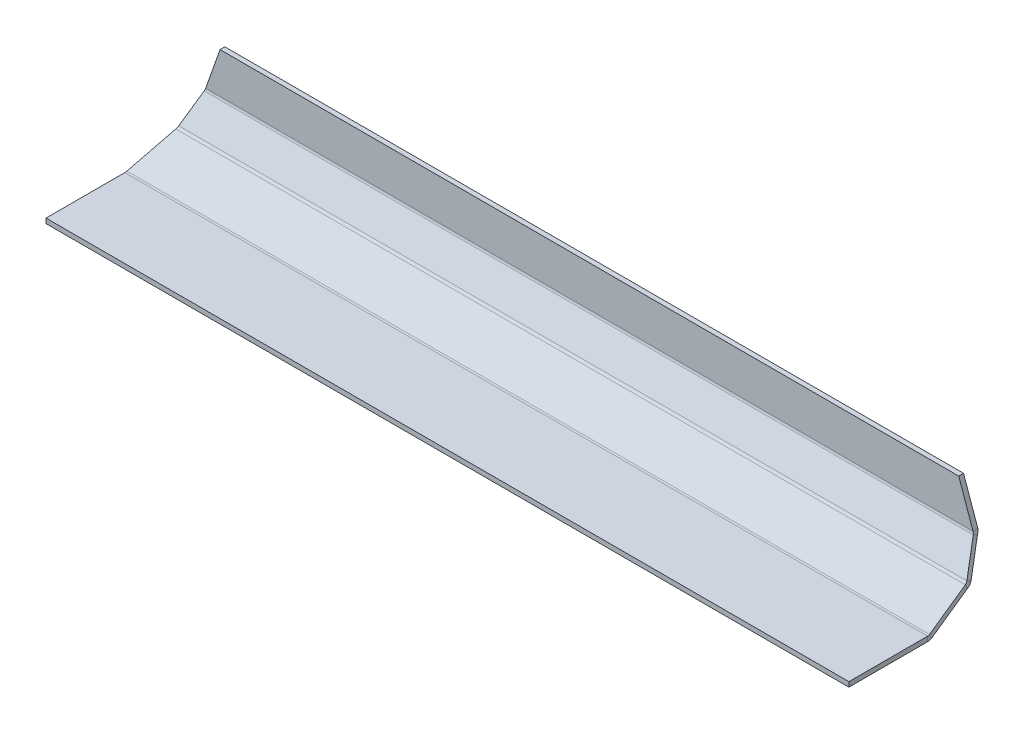
ISO-10303-21;
HEADER;
FILE_DESCRIPTION(('STEP AP214'),'2;1');
FILE_NAME('part.step','',(''),(''),'','','');
FILE_SCHEMA(('AUTOMOTIVE_DESIGN { 1 0 10303 214 1 1 1 1 }'));
ENDSEC;
DATA;
#1=APPLICATION_CONTEXT('core data for automotive mechanical design processes');
#2=APPLICATION_PROTOCOL_DEFINITION('international standard','automotive_design',2000,#1);
#3=PRODUCT_CONTEXT('',#1,'mechanical');
#4=PRODUCT('Part','Part','',(#3));
#5=PRODUCT_RELATED_PRODUCT_CATEGORY('part','',(#4));
#6=PRODUCT_DEFINITION_FORMATION('','',#4);
#7=PRODUCT_DEFINITION_CONTEXT('part definition',#1,'design');
#8=PRODUCT_DEFINITION('design','',#6,#7);
#9=PRODUCT_DEFINITION_SHAPE('','',#8);
#10=(LENGTH_UNIT() NAMED_UNIT(*) SI_UNIT(.MILLI.,.METRE.));
#11=(NAMED_UNIT(*) PLANE_ANGLE_UNIT() SI_UNIT($,.RADIAN.));
#12=(NAMED_UNIT(*) SI_UNIT($,.STERADIAN.) SOLID_ANGLE_UNIT());
#13=UNCERTAINTY_MEASURE_WITH_UNIT(LENGTH_MEASURE(1.E-05),#10,'distance_accuracy_value','');
#14=(GEOMETRIC_REPRESENTATION_CONTEXT(3) GLOBAL_UNCERTAINTY_ASSIGNED_CONTEXT((#13)) GLOBAL_UNIT_ASSIGNED_CONTEXT((#10,
#11,#12)) REPRESENTATION_CONTEXT('',''));
#15=CARTESIAN_POINT('',(0.,0.,0.));
#16=DIRECTION('',(0.,0.,1.));
#17=DIRECTION('',(1.,0.,0.));
#18=AXIS2_PLACEMENT_3D('',#15,#16,#17);
#19=CARTESIAN_POINT('',(250.,30.5600018860363,-91.3919041893581));
#20=DIRECTION('',(0.,0.,1.));
#21=DIRECTION('',(1.,0.,0.));
#22=AXIS2_PLACEMENT_3D('',#19,#20,#21);
#23=PLANE('',#22);
#24=DIRECTION('',(0.332795419999215,-0.94299905006715,0.));
#25=VECTOR('',#24,1.);
#26=CARTESIAN_POINT('',(240.409484031976,27.1753963666983,-91.3919041893581));
#27=LINE('',#26,#25);
#28=CARTESIAN_POINT('',(230.,56.6713959025862,-91.3919041893581));
#29=VERTEX_POINT('',#28);
#30=CARTESIAN_POINT('',(238.926191763171,31.3784085369328,-91.3919041893581));
#31=VERTEX_POINT('',#30);
#32=EDGE_CURVE('E272',#29,#31,#27,.T.);
#33=ORIENTED_EDGE('',*,*,#32,.T.);
#34=DIRECTION('',(-1.,0.,0.));
#35=VECTOR('',#34,1.);
#36=CARTESIAN_POINT('',(250.,31.3784085369328,-91.3919041893581));
#37=LINE('',#36,#35);
#38=CARTESIAN_POINT('',(-238.926191763171,31.3784085369328,-91.3919041893581));
#39=VERTEX_POINT('',#38);
#40=EDGE_CURVE('E289',#31,#39,#37,.T.);
#41=ORIENTED_EDGE('',*,*,#40,.T.);
#42=DIRECTION('',(-0.332795419999215,-0.94299905006715,0.));
#43=VECTOR('',#42,1.);
#44=CARTESIAN_POINT('',(-240.409484031976,27.1753963666983,-91.3919041893581));
#45=LINE('',#44,#43);
#46=CARTESIAN_POINT('',(-230.,56.6713959025862,-91.3919041893581));
#47=VERTEX_POINT('',#46);
#48=EDGE_CURVE('E224',#47,#39,#45,.T.);
#49=ORIENTED_EDGE('',*,*,#48,.F.);
#50=DIRECTION('',(-1.,0.,0.));
#51=VECTOR('',#50,1.);
#52=CARTESIAN_POINT('',(250.,56.6713959025862,-91.3919041893581));
#53=LINE('',#52,#51);
#54=EDGE_CURVE('E44',#29,#47,#53,.T.);
#55=ORIENTED_EDGE('',*,*,#54,.F.);
#56=EDGE_LOOP('',(#33,#41,#49,#55));
#57=FACE_BOUND('',#56,.T.);
#58=ADVANCED_FACE('F37',(#57),#23,.F.);
#59=CARTESIAN_POINT('',(250.,56.6713959025862,-88.391904189358));
#60=DIRECTION('',(0.,1.,0.));
#61=DIRECTION('',(0.,0.,1.));
#62=AXIS2_PLACEMENT_3D('',#59,#60,#61);
#63=PLANE('',#62);
#64=DIRECTION('',(-1.,0.,0.));
#65=VECTOR('',#64,1.);
#66=CARTESIAN_POINT('',(250.,56.6713959025862,-88.391904189358));
#67=LINE('',#66,#65);
#68=CARTESIAN_POINT('',(230.,56.6713959025862,-88.391904189358));
#69=VERTEX_POINT('',#68);
#70=CARTESIAN_POINT('',(-230.,56.6713959025862,-88.391904189358));
#71=VERTEX_POINT('',#70);
#72=EDGE_CURVE('E312',#69,#71,#67,.T.);
#73=ORIENTED_EDGE('',*,*,#72,.F.);
#74=DIRECTION('',(0.,0.,1.));
#75=VECTOR('',#74,1.);
#76=CARTESIAN_POINT('',(230.,56.6713959025862,-88.391904189358));
#77=LINE('',#76,#75);
#78=EDGE_CURVE('E275',#69,#29,#77,.F.);
#79=ORIENTED_EDGE('',*,*,#78,.T.);
#80=ORIENTED_EDGE('',*,*,#54,.T.);
#81=DIRECTION('',(0.,0.,1.));
#82=VECTOR('',#81,1.);
#83=CARTESIAN_POINT('',(-230.,56.6713959025862,-88.391904189358));
#84=LINE('',#83,#82);
#85=EDGE_CURVE('E227',#71,#47,#84,.F.);
#86=ORIENTED_EDGE('',*,*,#85,.F.);
#87=EDGE_LOOP('',(#73,#79,#80,#86));
#88=FACE_BOUND('',#87,.T.);
#89=ADVANCED_FACE('F317',(#88),#63,.T.);
#90=CARTESIAN_POINT('',(250.,30.5600018860363,-88.391904189358));
#91=DIRECTION('',(0.,0.,1.));
#92=DIRECTION('',(1.,0.,0.));
#93=AXIS2_PLACEMENT_3D('',#90,#91,#92);
#94=PLANE('',#93);
#95=DIRECTION('',(-1.,0.,0.));
#96=VECTOR('',#95,1.);
#97=CARTESIAN_POINT('',(250.,31.3784085369328,-88.391904189358));
#98=LINE('',#97,#96);
#99=CARTESIAN_POINT('',(238.926191763171,31.3784085369328,-88.391904189358));
#100=VERTEX_POINT('',#99);
#101=CARTESIAN_POINT('',(-238.926191763171,31.3784085369328,-88.391904189358));
#102=VERTEX_POINT('',#101);
#103=EDGE_CURVE('E310',#100,#102,#98,.T.);
#104=ORIENTED_EDGE('',*,*,#103,.F.);
#105=DIRECTION('',(0.332795419999215,-0.94299905006715,0.));
#106=VECTOR('',#105,1.);
#107=CARTESIAN_POINT('',(240.409484031976,27.1753963666983,-88.391904189358));
#108=LINE('',#107,#106);
#109=EDGE_CURVE('E260',#69,#100,#108,.T.);
#110=ORIENTED_EDGE('',*,*,#109,.F.);
#111=ORIENTED_EDGE('',*,*,#72,.T.);
#112=DIRECTION('',(-0.332795419999215,-0.94299905006715,0.));
#113=VECTOR('',#112,1.);
#114=CARTESIAN_POINT('',(-240.409484031976,27.1753963666983,-88.391904189358));
#115=LINE('',#114,#113);
#116=EDGE_CURVE('E213',#71,#102,#115,.T.);
#117=ORIENTED_EDGE('',*,*,#116,.T.);
#118=EDGE_LOOP('',(#104,#110,#111,#117));
#119=FACE_BOUND('',#118,.T.);
#120=ADVANCED_FACE('F350',(#119),#94,.T.);
#121=CARTESIAN_POINT('',(250.,31.3784085369328,-85.391904189358));
#122=DIRECTION('',(-1.,0.,0.));
#123=DIRECTION('',(0.,0.,1.));
#124=AXIS2_PLACEMENT_3D('',#121,#122,#123);
#125=CYLINDRICAL_SURFACE('',#124,3.);
#126=DIRECTION('',(-1.,0.,0.));
#127=VECTOR('',#126,1.);
#128=CARTESIAN_POINT('',(250.,29.8549710517579,-87.976307065994));
#129=LINE('',#128,#127);
#130=CARTESIAN_POINT('',(239.463830711678,29.8549710517579,-87.976307065994));
#131=VERTEX_POINT('',#130);
#132=CARTESIAN_POINT('',(-239.463830711678,29.8549710517579,-87.976307065994));
#133=VERTEX_POINT('',#132);
#134=EDGE_CURVE('E308',#131,#133,#129,.T.);
#135=ORIENTED_EDGE('',*,*,#134,.F.);
#136=CARTESIAN_POINT('',(238.926191763171,31.3784085369328,-85.391904189358));
#137=DIRECTION('',(-0.942999050067149,-0.332795419999215,0.));
#138=DIRECTION('',(-0.332795419999215,0.94299905006715,0.));
#139=AXIS2_PLACEMENT_3D('',#136,#137,#138);
#140=ELLIPSE('',#139,3.18133936591598,3.);
#141=EDGE_CURVE('E244',#100,#131,#140,.T.);
#142=ORIENTED_EDGE('',*,*,#141,.F.);
#143=ORIENTED_EDGE('',*,*,#103,.T.);
#144=CARTESIAN_POINT('',(-238.926191763171,31.3784085369328,-85.391904189358));
#145=DIRECTION('',(-0.942999050067149,0.332795419999215,0.));
#146=DIRECTION('',(0.332795419999215,0.94299905006715,0.));
#147=AXIS2_PLACEMENT_3D('',#144,#145,#146);
#148=ELLIPSE('',#147,3.18133936591598,3.);
#149=EDGE_CURVE('E198',#102,#133,#148,.T.);
#150=ORIENTED_EDGE('',*,*,#149,.T.);
#151=EDGE_LOOP('',(#135,#142,#143,#150));
#152=FACE_BOUND('',#151,.T.);
#153=ADVANCED_FACE('F345',(#152),#125,.F.);
#154=CARTESIAN_POINT('',(250.,12.1853172077233,-77.5605111158262));
#155=DIRECTION('',(0.,0.507812495058289,0.86146762554531));
#156=DIRECTION('',(0.,-0.86146762554531,0.507812495058289));
#157=AXIS2_PLACEMENT_3D('',#154,#155,#156);
#158=PLANE('',#157);
#159=DIRECTION('',(-1.,0.,0.));
#160=VECTOR('',#159,1.);
#161=CARTESIAN_POINT('',(250.,13.0213616497398,-78.0533373132254));
#162=LINE('',#161,#160);
#163=CARTESIAN_POINT('',(245.404608818134,13.0213616497398,-78.0533373132254));
#164=VERTEX_POINT('',#163);
#165=CARTESIAN_POINT('',(-245.404608818134,13.0213616497398,-78.0533373132254));
#166=VERTEX_POINT('',#165);
#167=EDGE_CURVE('E306',#164,#166,#162,.T.);
#168=ORIENTED_EDGE('',*,*,#167,.F.);
#169=DIRECTION('',(0.290876314246122,-0.824218338166353,0.485855020392799));
#170=VECTOR('',#169,1.);
#171=CARTESIAN_POINT('',(246.063506409688,11.1543293362275,-76.9527708968392));
#172=LINE('',#171,#170);
#173=EDGE_CURVE('E254',#131,#164,#172,.T.);
#174=ORIENTED_EDGE('',*,*,#173,.F.);
#175=ORIENTED_EDGE('',*,*,#134,.T.);
#176=DIRECTION('',(-0.290876314246122,-0.824218338166353,0.485855020392799));
#177=VECTOR('',#176,1.);
#178=CARTESIAN_POINT('',(-246.063506409688,11.1543293362275,-76.9527708968392));
#179=LINE('',#178,#177);
#180=EDGE_CURVE('E207',#133,#166,#179,.T.);
#181=ORIENTED_EDGE('',*,*,#180,.T.);
#182=EDGE_LOOP('',(#168,#174,#175,#181));
#183=FACE_BOUND('',#182,.T.);
#184=ADVANCED_FACE('F360',(#183),#158,.T.);
#185=CARTESIAN_POINT('',(250.,14.5447991349147,-75.4689344365894));
#186=DIRECTION('',(-1.,0.,0.));
#187=DIRECTION('',(0.,0.,1.));
#188=AXIS2_PLACEMENT_3D('',#185,#186,#187);
#189=CYLINDRICAL_SURFACE('',#188,3.);
#190=DIRECTION('',(-1.,0.,0.));
#191=VECTOR('',#190,1.);
#192=CARTESIAN_POINT('',(250.,11.7963271302081,-76.6713909386485));
#193=LINE('',#192,#191);
#194=CARTESIAN_POINT('',(245.836937861744,11.7963271302081,-76.6713909386485));
#195=VERTEX_POINT('',#194);
#196=CARTESIAN_POINT('',(-245.836937861744,11.7963271302081,-76.6713909386485));
#197=VERTEX_POINT('',#196);
#198=EDGE_CURVE('E304',#195,#197,#193,.T.);
#199=ORIENTED_EDGE('',*,*,#198,.F.);
#200=CARTESIAN_POINT('',(244.866969869627,14.5447991349147,-75.4689344365894));
#201=DIRECTION('',(-0.942999050067149,-0.332795419999215,0.));
#202=DIRECTION('',(-0.332795419999215,0.94299905006715,0.));
#203=AXIS2_PLACEMENT_3D('',#200,#201,#202);
#204=ELLIPSE('',#203,3.18133936591598,3.);
#205=EDGE_CURVE('E238',#164,#195,#204,.T.);
#206=ORIENTED_EDGE('',*,*,#205,.F.);
#207=ORIENTED_EDGE('',*,*,#167,.T.);
#208=CARTESIAN_POINT('',(-244.866969869627,14.5447991349147,-75.4689344365894));
#209=DIRECTION('',(-0.942999050067149,0.332795419999215,0.));
#210=DIRECTION('',(0.332795419999215,0.94299905006715,0.));
#211=AXIS2_PLACEMENT_3D('',#208,#209,#210);
#212=ELLIPSE('',#211,3.18133936591598,3.);
#213=EDGE_CURVE('E186',#166,#197,#212,.T.);
#214=ORIENTED_EDGE('',*,*,#213,.T.);
#215=EDGE_LOOP('',(#199,#206,#207,#214));
#216=FACE_BOUND('',#215,.T.);
#217=ADVANCED_FACE('F364',(#216),#189,.F.);
#218=CARTESIAN_POINT('',(250.,0.,-49.7083574981729));
#219=DIRECTION('',(0.,0.916157334902189,0.400818834019708));
#220=DIRECTION('',(0.,-0.400818834019707,0.916157334902189));
#221=AXIS2_PLACEMENT_3D('',#218,#219,#220);
#222=PLANE('',#221);
#223=DIRECTION('',(-1.,0.,0.));
#224=VECTOR('',#223,1.);
#225=CARTESIAN_POINT('',(250.,0.251527995293396,-50.2832786302721));
#226=LINE('',#225,#224);
#227=CARTESIAN_POINT('',(249.911232821678,0.251527995293396,-50.2832786302721));
#228=VERTEX_POINT('',#227);
#229=CARTESIAN_POINT('',(-249.911232821678,0.251527995293396,-50.2832786302721));
#230=VERTEX_POINT('',#229);
#231=EDGE_CURVE('E302',#228,#230,#226,.T.);
#232=ORIENTED_EDGE('',*,*,#231,.F.);
#233=DIRECTION('',(0.140059371872476,-0.396868005662632,0.907126870086016));
#234=VECTOR('',#233,1.);
#235=CARTESIAN_POINT('',(250.,0.,-49.7083574981729));
#236=LINE('',#235,#234);
#237=EDGE_CURVE('E243',#195,#228,#236,.T.);
#238=ORIENTED_EDGE('',*,*,#237,.F.);
#239=ORIENTED_EDGE('',*,*,#198,.T.);
#240=DIRECTION('',(-0.140059371872476,-0.396868005662632,0.907126870086016));
#241=VECTOR('',#240,1.);
#242=CARTESIAN_POINT('',(-250.,0.,-49.7083574981729));
#243=LINE('',#242,#241);
#244=EDGE_CURVE('E197',#197,#230,#243,.T.);
#245=ORIENTED_EDGE('',*,*,#244,.T.);
#246=EDGE_LOOP('',(#232,#238,#239,#245));
#247=FACE_BOUND('',#246,.T.);
#248=ADVANCED_FACE('F374',(#247),#222,.T.);
#249=CARTESIAN_POINT('',(250.,2.99999999999998,-49.0808221282129));
#250=DIRECTION('',(-1.,0.,0.));
#251=DIRECTION('',(0.,0.,1.));
#252=AXIS2_PLACEMENT_3D('',#249,#250,#251);
#253=CYLINDRICAL_SURFACE('',#252,3.);
#254=DIRECTION('',(-1.,0.,0.));
#255=VECTOR('',#254,1.);
#256=CARTESIAN_POINT('',(250.,0.,-49.0808221282129));
#257=LINE('',#256,#255);
#258=CARTESIAN_POINT('',(250.,0.,-49.0808221282129));
#259=VERTEX_POINT('',#258);
#260=CARTESIAN_POINT('',(-250.,0.,-49.0808221282129));
#261=VERTEX_POINT('',#260);
#262=EDGE_CURVE('E300',#259,#261,#257,.T.);
#263=ORIENTED_EDGE('',*,*,#262,.F.);
#264=CARTESIAN_POINT('',(248.94126482956,2.99999999999998,-49.0808221282129));
#265=DIRECTION('',(-0.942999050067149,-0.332795419999215,0.));
#266=DIRECTION('',(-0.332795419999215,0.94299905006715,0.));
#267=AXIS2_PLACEMENT_3D('',#264,#265,#266);
#268=ELLIPSE('',#267,3.18133936591598,3.);
#269=EDGE_CURVE('E176',#228,#259,#268,.T.);
#270=ORIENTED_EDGE('',*,*,#269,.F.);
#271=ORIENTED_EDGE('',*,*,#231,.T.);
#272=CARTESIAN_POINT('',(-248.94126482956,2.99999999999998,-49.0808221282129));
#273=DIRECTION('',(-0.942999050067149,0.332795419999215,0.));
#274=DIRECTION('',(0.332795419999215,0.94299905006715,0.));
#275=AXIS2_PLACEMENT_3D('',#272,#273,#274);
#276=ELLIPSE('',#275,3.18133936591598,3.);
#277=EDGE_CURVE('E187',#230,#261,#276,.T.);
#278=ORIENTED_EDGE('',*,*,#277,.T.);
#279=EDGE_LOOP('',(#263,#270,#271,#278));
#280=FACE_BOUND('',#279,.T.);
#281=ADVANCED_FACE('F380',(#280),#253,.F.);
#282=CARTESIAN_POINT('',(250.,2.99999999999998,-49.0808221282129));
#283=DIRECTION('',(-1.,0.,0.));
#284=DIRECTION('',(0.,0.,1.));
#285=AXIS2_PLACEMENT_3D('',#282,#283,#284);
#286=CYLINDRICAL_SURFACE('',#285,6.);
#287=CARTESIAN_POINT('',(248.94126482956,2.99999999999998,-49.0808221282129));
#288=DIRECTION('',(-0.984786040679908,-0.173771269437703,0.));
#289=DIRECTION('',(-0.173771269437703,0.984786040679908,0.));
#290=AXIS2_PLACEMENT_3D('',#287,#288,#289);
#291=ELLIPSE('',#290,6.09269399864516,6.);
#292=CARTESIAN_POINT('',(249.911232821678,-2.49694400941315,-51.4857351323312));
#293=VERTEX_POINT('',#292);
#294=CARTESIAN_POINT('',(250.,-3.00000000000002,-49.0808221282129));
#295=VERTEX_POINT('',#294);
#296=EDGE_CURVE('E158',#293,#295,#291,.T.);
#297=ORIENTED_EDGE('',*,*,#296,.T.);
#298=DIRECTION('',(-1.,0.,0.));
#299=VECTOR('',#298,1.);
#300=CARTESIAN_POINT('',(250.,-3.00000000000002,-49.0808221282129));
#301=LINE('',#300,#299);
#302=CARTESIAN_POINT('',(-250.,-3.00000000000002,-49.0808221282129));
#303=VERTEX_POINT('',#302);
#304=EDGE_CURVE('E152',#295,#303,#301,.T.);
#305=ORIENTED_EDGE('',*,*,#304,.T.);
#306=CARTESIAN_POINT('',(-248.94126482956,2.99999999999998,-49.0808221282129));
#307=DIRECTION('',(-0.984786040679908,0.173771269437703,0.));
#308=DIRECTION('',(0.173771269437703,0.984786040679908,0.));
#309=AXIS2_PLACEMENT_3D('',#306,#307,#308);
#310=ELLIPSE('',#309,6.09269399864516,6.);
#311=CARTESIAN_POINT('',(-249.911232821678,-2.49694400941315,-51.4857351323312));
#312=VERTEX_POINT('',#311);
#313=EDGE_CURVE('E157',#312,#303,#310,.T.);
#314=ORIENTED_EDGE('',*,*,#313,.F.);
#315=DIRECTION('',(-1.,0.,0.));
#316=VECTOR('',#315,1.);
#317=CARTESIAN_POINT('',(250.,-2.49694400941317,-51.4857351323312));
#318=LINE('',#317,#316);
#319=EDGE_CURVE('E162',#293,#312,#318,.T.);
#320=ORIENTED_EDGE('',*,*,#319,.F.);
#321=EDGE_LOOP('',(#297,#305,#314,#320));
#322=FACE_BOUND('',#321,.T.);
#323=ADVANCED_FACE('F154',(#322),#286,.T.);
#324=CARTESIAN_POINT('',(250.,-2.74847200470657,-50.910814000232));
#325=DIRECTION('',(0.,0.916157334902189,0.400818834019707));
#326=DIRECTION('',(0.,-0.400818834019707,0.916157334902189));
#327=AXIS2_PLACEMENT_3D('',#324,#325,#326);
#328=PLANE('',#327);
#329=DIRECTION('',(0.140059371872476,-0.396868005662632,0.907126870086016));
#330=VECTOR('',#329,1.);
#331=CARTESIAN_POINT('',(250.,-2.74847200470657,-50.910814000232));
#332=LINE('',#331,#330);
#333=CARTESIAN_POINT('',(245.836937861744,9.04785512550152,-77.8738474407077));
#334=VERTEX_POINT('',#333);
#335=EDGE_CURVE('E263',#334,#293,#332,.T.);
#336=ORIENTED_EDGE('',*,*,#335,.T.);
#337=ORIENTED_EDGE('',*,*,#319,.T.);
#338=DIRECTION('',(-0.140059371872476,-0.396868005662632,0.907126870086016));
#339=VECTOR('',#338,1.);
#340=CARTESIAN_POINT('',(-250.,-2.74847200470657,-50.910814000232));
#341=LINE('',#340,#339);
#342=CARTESIAN_POINT('',(-245.836937861744,9.04785512550152,-77.8738474407077));
#343=VERTEX_POINT('',#342);
#344=EDGE_CURVE('E216',#343,#312,#341,.T.);
#345=ORIENTED_EDGE('',*,*,#344,.F.);
#346=DIRECTION('',(-1.,0.,0.));
#347=VECTOR('',#346,1.);
#348=CARTESIAN_POINT('',(250.,9.04785512550152,-77.8738474407077));
#349=LINE('',#348,#347);
#350=EDGE_CURVE('E295',#334,#343,#349,.T.);
#351=ORIENTED_EDGE('',*,*,#350,.F.);
#352=EDGE_LOOP('',(#336,#337,#345,#351));
#353=FACE_BOUND('',#352,.T.);
#354=ADVANCED_FACE('F386',(#353),#328,.F.);
#355=CARTESIAN_POINT('',(250.,14.5447991349147,-75.4689344365894));
#356=DIRECTION('',(-1.,0.,0.));
#357=DIRECTION('',(0.,0.,1.));
#358=AXIS2_PLACEMENT_3D('',#355,#356,#357);
#359=CYLINDRICAL_SURFACE('',#358,6.);
#360=CARTESIAN_POINT('',(244.866969869627,14.5447991349147,-75.4689344365894));
#361=DIRECTION('',(-0.984786040679908,-0.173771269437705,0.));
#362=DIRECTION('',(-0.173771269437705,0.984786040679908,0.));
#363=AXIS2_PLACEMENT_3D('',#360,#361,#362);
#364=ELLIPSE('',#363,6.09269399864516,6.);
#365=CARTESIAN_POINT('',(245.404608818134,11.4979241645649,-80.6377401898613));
#366=VERTEX_POINT('',#365);
#367=EDGE_CURVE('E246',#366,#334,#364,.T.);
#368=ORIENTED_EDGE('',*,*,#367,.T.);
#369=ORIENTED_EDGE('',*,*,#350,.T.);
#370=CARTESIAN_POINT('',(-244.866969869627,14.5447991349147,-75.4689344365894));
#371=DIRECTION('',(-0.984786040679908,0.173771269437705,0.));
#372=DIRECTION('',(0.173771269437705,0.984786040679908,0.));
#373=AXIS2_PLACEMENT_3D('',#370,#371,#372);
#374=ELLIPSE('',#373,6.09269399864516,6.);
#375=CARTESIAN_POINT('',(-245.404608818134,11.4979241645649,-80.6377401898613));
#376=VERTEX_POINT('',#375);
#377=EDGE_CURVE('E190',#376,#343,#374,.T.);
#378=ORIENTED_EDGE('',*,*,#377,.F.);
#379=DIRECTION('',(-1.,0.,0.));
#380=VECTOR('',#379,1.);
#381=CARTESIAN_POINT('',(250.,11.4979241645649,-80.6377401898613));
#382=LINE('',#381,#380);
#383=EDGE_CURVE('E293',#366,#376,#382,.T.);
#384=ORIENTED_EDGE('',*,*,#383,.F.);
#385=EDGE_LOOP('',(#368,#369,#378,#384));
#386=FACE_BOUND('',#385,.T.);
#387=ADVANCED_FACE('F388',(#386),#359,.T.);
#388=CARTESIAN_POINT('',(250.,10.6618797225484,-80.1449139924621));
#389=DIRECTION('',(0.,0.507812495058289,0.86146762554531));
#390=DIRECTION('',(0.,-0.86146762554531,0.507812495058289));
#391=AXIS2_PLACEMENT_3D('',#388,#389,#390);
#392=PLANE('',#391);
#393=DIRECTION('',(0.290876314246122,-0.824218338166353,0.485855020392799));
#394=VECTOR('',#393,1.);
#395=CARTESIAN_POINT('',(246.063506409688,9.63089185105266,-79.5371737734751));
#396=LINE('',#395,#394);
#397=CARTESIAN_POINT('',(239.463830711678,28.331533566583,-90.5607099426299));
#398=VERTEX_POINT('',#397);
#399=EDGE_CURVE('E250',#398,#366,#396,.T.);
#400=ORIENTED_EDGE('',*,*,#399,.T.);
#401=ORIENTED_EDGE('',*,*,#383,.T.);
#402=DIRECTION('',(-0.290876314246122,-0.824218338166353,0.485855020392799));
#403=VECTOR('',#402,1.);
#404=CARTESIAN_POINT('',(-246.063506409688,9.63089185105266,-79.5371737734751));
#405=LINE('',#404,#403);
#406=CARTESIAN_POINT('',(-239.463830711678,28.331533566583,-90.5607099426299));
#407=VERTEX_POINT('',#406);
#408=EDGE_CURVE('E203',#407,#376,#405,.T.);
#409=ORIENTED_EDGE('',*,*,#408,.F.);
#410=DIRECTION('',(-1.,0.,0.));
#411=VECTOR('',#410,1.);
#412=CARTESIAN_POINT('',(250.,28.331533566583,-90.5607099426299));
#413=LINE('',#412,#411);
#414=EDGE_CURVE('E291',#398,#407,#413,.T.);
#415=ORIENTED_EDGE('',*,*,#414,.F.);
#416=EDGE_LOOP('',(#400,#401,#409,#415));
#417=FACE_BOUND('',#416,.T.);
#418=ADVANCED_FACE('F390',(#417),#392,.F.);
#419=CARTESIAN_POINT('',(250.,31.3784085369328,-85.391904189358));
#420=DIRECTION('',(-1.,0.,0.));
#421=DIRECTION('',(0.,0.,1.));
#422=AXIS2_PLACEMENT_3D('',#419,#420,#421);
#423=CYLINDRICAL_SURFACE('',#422,6.);
#424=CARTESIAN_POINT('',(238.926191763171,31.3784085369328,-85.391904189358));
#425=DIRECTION('',(-0.984786040679908,-0.173771269437705,0.));
#426=DIRECTION('',(-0.173771269437705,0.984786040679908,0.));
#427=AXIS2_PLACEMENT_3D('',#424,#425,#426);
#428=ELLIPSE('',#427,6.09269399864516,6.);
#429=EDGE_CURVE('E240',#31,#398,#428,.T.);
#430=ORIENTED_EDGE('',*,*,#429,.T.);
#431=ORIENTED_EDGE('',*,*,#414,.T.);
#432=CARTESIAN_POINT('',(-238.926191763171,31.3784085369328,-85.391904189358));
#433=DIRECTION('',(-0.984786040679908,0.173771269437705,0.));
#434=DIRECTION('',(0.173771269437705,0.984786040679908,0.));
#435=AXIS2_PLACEMENT_3D('',#432,#433,#434);
#436=ELLIPSE('',#435,6.09269399864516,6.);
#437=EDGE_CURVE('E194',#39,#407,#436,.T.);
#438=ORIENTED_EDGE('',*,*,#437,.F.);
#439=ORIENTED_EDGE('',*,*,#40,.F.);
#440=EDGE_LOOP('',(#430,#431,#438,#439));
#441=FACE_BOUND('',#440,.T.);
#442=ADVANCED_FACE('F332',(#441),#423,.T.);
#443=CARTESIAN_POINT('',(250.,0.,0.));
#444=DIRECTION('',(0.,1.,0.));
#445=DIRECTION('',(0.,0.,1.));
#446=AXIS2_PLACEMENT_3D('',#443,#444,#445);
#447=PLANE('',#446);
#448=ORIENTED_EDGE('',*,*,#262,.T.);
#449=DIRECTION('',(0.,0.,-1.));
#450=VECTOR('',#449,1.);
#451=CARTESIAN_POINT('',(-250.,0.,0.));
#452=LINE('',#451,#450);
#453=CARTESIAN_POINT('',(-250.,0.,0.));
#454=VERTEX_POINT('',#453);
#455=EDGE_CURVE('E172',#454,#261,#452,.T.);
#456=ORIENTED_EDGE('',*,*,#455,.F.);
#457=DIRECTION('',(-1.,0.,0.));
#458=VECTOR('',#457,1.);
#459=CARTESIAN_POINT('',(250.,0.,0.));
#460=LINE('',#459,#458);
#461=CARTESIAN_POINT('',(250.,0.,0.));
#462=VERTEX_POINT('',#461);
#463=EDGE_CURVE('E59',#462,#454,#460,.T.);
#464=ORIENTED_EDGE('',*,*,#463,.F.);
#465=DIRECTION('',(0.,0.,-1.));
#466=VECTOR('',#465,1.);
#467=CARTESIAN_POINT('',(250.,0.,0.));
#468=LINE('',#467,#466);
#469=EDGE_CURVE('E281',#462,#259,#468,.T.);
#470=ORIENTED_EDGE('',*,*,#469,.T.);
#471=EDGE_LOOP('',(#448,#456,#464,#470));
#472=FACE_BOUND('',#471,.T.);
#473=ADVANCED_FACE('F423',(#472),#447,.T.);
#474=CARTESIAN_POINT('',(250.,-3.,0.));
#475=DIRECTION('',(0.,0.,1.));
#476=DIRECTION('',(1.,0.,0.));
#477=AXIS2_PLACEMENT_3D('',#474,#475,#476);
#478=PLANE('',#477);
#479=ORIENTED_EDGE('',*,*,#463,.T.);
#480=DIRECTION('',(0.,1.,0.));
#481=VECTOR('',#480,1.);
#482=CARTESIAN_POINT('',(-250.,-3.,0.));
#483=LINE('',#482,#481);
#484=CARTESIAN_POINT('',(-250.,-3.,0.));
#485=VERTEX_POINT('',#484);
#486=EDGE_CURVE('E179',#485,#454,#483,.T.);
#487=ORIENTED_EDGE('',*,*,#486,.F.);
#488=DIRECTION('',(-1.,0.,0.));
#489=VECTOR('',#488,1.);
#490=CARTESIAN_POINT('',(250.,-3.,0.));
#491=LINE('',#490,#489);
#492=CARTESIAN_POINT('',(250.,-3.,0.));
#493=VERTEX_POINT('',#492);
#494=EDGE_CURVE('E51',#493,#485,#491,.T.);
#495=ORIENTED_EDGE('',*,*,#494,.F.);
#496=DIRECTION('',(0.,1.,0.));
#497=VECTOR('',#496,1.);
#498=CARTESIAN_POINT('',(250.,-3.,0.));
#499=LINE('',#498,#497);
#500=EDGE_CURVE('E285',#493,#462,#499,.T.);
#501=ORIENTED_EDGE('',*,*,#500,.T.);
#502=EDGE_LOOP('',(#479,#487,#495,#501));
#503=FACE_BOUND('',#502,.T.);
#504=ADVANCED_FACE('F426',(#503),#478,.T.);
#505=CARTESIAN_POINT('',(250.,-3.,0.));
#506=DIRECTION('',(0.,1.,0.));
#507=DIRECTION('',(0.,0.,1.));
#508=AXIS2_PLACEMENT_3D('',#505,#506,#507);
#509=PLANE('',#508);
#510=ORIENTED_EDGE('',*,*,#494,.T.);
#511=DIRECTION('',(0.,0.,-1.));
#512=VECTOR('',#511,1.);
#513=CARTESIAN_POINT('',(-250.,-3.,0.));
#514=LINE('',#513,#512);
#515=EDGE_CURVE('E171',#485,#303,#514,.T.);
#516=ORIENTED_EDGE('',*,*,#515,.T.);
#517=ORIENTED_EDGE('',*,*,#304,.F.);
#518=DIRECTION('',(0.,0.,-1.));
#519=VECTOR('',#518,1.);
#520=CARTESIAN_POINT('',(250.,-3.,0.));
#521=LINE('',#520,#519);
#522=EDGE_CURVE('E287',#493,#295,#521,.T.);
#523=ORIENTED_EDGE('',*,*,#522,.F.);
#524=EDGE_LOOP('',(#510,#516,#517,#523));
#525=FACE_BOUND('',#524,.T.);
#526=ADVANCED_FACE('F178',(#525),#509,.F.);
#527=CARTESIAN_POINT('',(250.,31.3784085369328,-85.391904189358));
#528=DIRECTION('',(-1.,0.,0.));
#529=DIRECTION('',(0.,0.,1.));
#530=AXIS2_PLACEMENT_3D('',#527,#528,#529);
#531=PLANE('',#530);
#532=ORIENTED_EDGE('',*,*,#522,.T.);
#533=DIRECTION('',(0.,1.,0.));
#534=VECTOR('',#533,1.);
#535=CARTESIAN_POINT('',(250.,-3.00000000000002,-49.0808221282129));
#536=LINE('',#535,#534);
#537=EDGE_CURVE('E11',#295,#259,#536,.T.);
#538=ORIENTED_EDGE('',*,*,#537,.T.);
#539=ORIENTED_EDGE('',*,*,#469,.F.);
#540=ORIENTED_EDGE('',*,*,#500,.F.);
#541=EDGE_LOOP('',(#532,#538,#539,#540));
#542=FACE_BOUND('',#541,.T.);
#543=ADVANCED_FACE('F431',(#542),#531,.F.);
#544=CARTESIAN_POINT('',(240.409484031976,27.1753963666983,-88.391904189358));
#545=DIRECTION('',(-0.942999050067149,-0.332795419999215,0.));
#546=DIRECTION('',(0.332795419999215,-0.94299905006715,0.));
#547=AXIS2_PLACEMENT_3D('',#544,#545,#546);
#548=PLANE('',#547);
#549=ORIENTED_EDGE('',*,*,#109,.T.);
#550=DIRECTION('',(0.,0.,1.));
#551=VECTOR('',#550,1.);
#552=CARTESIAN_POINT('',(238.926191763171,31.3784085369328,-88.391904189358));
#553=LINE('',#552,#551);
#554=EDGE_CURVE('E278',#100,#31,#553,.F.);
#555=ORIENTED_EDGE('',*,*,#554,.T.);
#556=ORIENTED_EDGE('',*,*,#32,.F.);
#557=ORIENTED_EDGE('',*,*,#78,.F.);
#558=EDGE_LOOP('',(#549,#555,#556,#557));
#559=FACE_BOUND('',#558,.T.);
#560=ADVANCED_FACE('F352',(#559),#548,.F.);
#561=CARTESIAN_POINT('',(250.,0.,-49.7083574981729));
#562=DIRECTION('',(-0.990143107005592,-0.0561384341274584,0.128316420862762));
#563=DIRECTION('',(0.140059371872476,-0.396868005662632,0.907126870086016));
#564=AXIS2_PLACEMENT_3D('',#561,#562,#563);
#565=PLANE('',#564);
#566=ORIENTED_EDGE('',*,*,#237,.T.);
#567=DIRECTION('',(0.,0.916157334902189,0.400818834019708));
#568=VECTOR('',#567,1.);
#569=CARTESIAN_POINT('',(249.911232821678,0.251527995293396,-50.2832786302721));
#570=LINE('',#569,#568);
#571=EDGE_CURVE('E256',#228,#293,#570,.F.);
#572=ORIENTED_EDGE('',*,*,#571,.T.);
#573=ORIENTED_EDGE('',*,*,#335,.F.);
#574=DIRECTION('',(0.,0.916157334902189,0.400818834019708));
#575=VECTOR('',#574,1.);
#576=CARTESIAN_POINT('',(245.836937861744,11.7963271302081,-76.6713909386485));
#577=LINE('',#576,#575);
#578=EDGE_CURVE('E266',#195,#334,#577,.F.);
#579=ORIENTED_EDGE('',*,*,#578,.F.);
#580=EDGE_LOOP('',(#566,#572,#573,#579));
#581=FACE_BOUND('',#580,.T.);
#582=ADVANCED_FACE('F370',(#581),#565,.F.);
#583=CARTESIAN_POINT('',(243.808234699187,17.5447991349147,-75.4689344365894));
#584=CARTESIAN_POINT('',(243.808234699187,18.5447991349147,-75.4689344365894));
#585=CARTESIAN_POINT('',(243.808234699187,19.5447991349147,-75.4689344365894));
#586=CARTESIAN_POINT('',(243.808234699187,20.5447991349147,-75.4689344365894));
#587=CARTESIAN_POINT('',(243.808234699187,17.5447991349147,-81.4689344365894));
#588=CARTESIAN_POINT('',(243.808234699187,18.5447991349147,-83.4689344365895));
#589=CARTESIAN_POINT('',(243.808234699187,19.5447991349147,-85.4689344365895));
#590=CARTESIAN_POINT('',(243.808234699187,20.5447991349147,-87.4689344365894));
#591=CARTESIAN_POINT('',(245.925705040067,11.5447991349147,-81.4689344365894));
#592=CARTESIAN_POINT('',(245.925705040067,10.5447991349147,-83.4689344365895));
#593=CARTESIAN_POINT('',(245.925705040067,9.54479913491467,-85.4689344365895));
#594=CARTESIAN_POINT('',(245.925705040067,8.54479913491466,-87.4689344365894));
#595=CARTESIAN_POINT('',(245.925705040067,11.5447991349147,-75.4689344365894));
#596=CARTESIAN_POINT('',(245.925705040067,10.5447991349147,-75.4689344365894));
#597=CARTESIAN_POINT('',(245.925705040067,9.54479913491466,-75.4689344365894));
#598=CARTESIAN_POINT('',(245.925705040067,8.54479913491466,-75.4689344365894));
#599=CARTESIAN_POINT('',(245.925705040067,11.5447991349147,-69.4689344365894));
#600=CARTESIAN_POINT('',(245.925705040067,10.5447991349147,-67.4689344365894));
#601=CARTESIAN_POINT('',(245.925705040067,9.54479913491466,-65.4689344365894));
#602=CARTESIAN_POINT('',(245.925705040067,8.54479913491466,-63.4689344365894));
#603=CARTESIAN_POINT('',(243.808234699187,17.5447991349147,-69.4689344365894));
#604=CARTESIAN_POINT('',(243.808234699187,18.5447991349147,-67.4689344365894));
#605=CARTESIAN_POINT('',(243.808234699187,19.5447991349147,-65.4689344365894));
#606=CARTESIAN_POINT('',(243.808234699187,20.5447991349147,-63.4689344365894));
#607=CARTESIAN_POINT('',(243.808234699187,17.5447991349147,-75.4689344365894));
#608=CARTESIAN_POINT('',(243.808234699187,18.5447991349147,-75.4689344365894));
#609=CARTESIAN_POINT('',(243.808234699187,19.5447991349147,-75.4689344365894));
#610=CARTESIAN_POINT('',(243.808234699187,20.5447991349147,-75.4689344365894));
#611=(BOUNDED_SURFACE() B_SPLINE_SURFACE(3,3,((#583,#584,#585,#586),(#587,#588,#589,#590),(#591,
#592,#593,#594),(#595,#596,#597,#598),(#599,#600,#601,#602),(#603,#604,#605,#606),(#607,#608,
#609,#610)),.UNSPECIFIED.,.T.,.F.,.F.) B_SPLINE_SURFACE_WITH_KNOTS((4,3,4),(4,4),(0.,0.5,1.),
(0.,1.),.UNSPECIFIED.) GEOMETRIC_REPRESENTATION_ITEM() RATIONAL_B_SPLINE_SURFACE(((1.,1.,1.,1.),
(0.333333333333333,0.333333333333333,0.333333333333333,0.333333333333333),(0.333333333333333,
0.333333333333333,0.333333333333333,0.333333333333333),(1.,1.,1.,1.),(0.333333333333333,
0.333333333333333,0.333333333333333,0.333333333333333),(0.333333333333333,0.333333333333333,
0.333333333333333,0.333333333333333),(1.,1.,1.,1.))) REPRESENTATION_ITEM('') SURFACE());
#612=DIRECTION('',(0.,0.507812495058289,0.86146762554531));
#613=VECTOR('',#612,1.);
#614=CARTESIAN_POINT('',(245.404608818134,13.0213616497398,-78.0533373132254));
#615=LINE('',#614,#613);
#616=EDGE_CURVE('E257',#164,#366,#615,.F.);
#617=ORIENTED_EDGE('',*,*,#205,.T.);
#618=ORIENTED_EDGE('',*,*,#578,.T.);
#619=ORIENTED_EDGE('',*,*,#367,.F.);
#620=ORIENTED_EDGE('',*,*,#616,.F.);
#621=EDGE_LOOP('',(#617,#618,#619,#620));
#622=FACE_BOUND('',#621,.T.);
#623=ADVANCED_FACE('F367',(#622),#611,.T.);
#624=CARTESIAN_POINT('',(246.063506409688,11.1543293362275,-76.9527708968392));
#625=DIRECTION('',(-0.956760664853333,-0.250580527760978,0.147710626890682));
#626=DIRECTION('',(0.290876314246122,-0.824218338166353,0.485855020392799));
#627=AXIS2_PLACEMENT_3D('',#624,#625,#626);
#628=PLANE('',#627);
#629=ORIENTED_EDGE('',*,*,#173,.T.);
#630=ORIENTED_EDGE('',*,*,#616,.T.);
#631=ORIENTED_EDGE('',*,*,#399,.F.);
#632=DIRECTION('',(0.,0.507812495058289,0.86146762554531));
#633=VECTOR('',#632,1.);
#634=CARTESIAN_POINT('',(239.463830711678,29.8549710517579,-87.976307065994));
#635=LINE('',#634,#633);
#636=EDGE_CURVE('E253',#131,#398,#635,.F.);
#637=ORIENTED_EDGE('',*,*,#636,.F.);
#638=EDGE_LOOP('',(#629,#630,#631,#637));
#639=FACE_BOUND('',#638,.T.);
#640=ADVANCED_FACE('F358',(#639),#628,.F.);
#641=CARTESIAN_POINT('',(237.867456592731,34.3784085369328,-85.391904189358));
#642=CARTESIAN_POINT('',(237.867456592731,35.3784085369328,-85.391904189358));
#643=CARTESIAN_POINT('',(237.867456592731,36.3784085369328,-85.391904189358));
#644=CARTESIAN_POINT('',(237.867456592731,37.3784085369328,-85.391904189358));
#645=CARTESIAN_POINT('',(237.867456592731,34.3784085369328,-91.3919041893581));
#646=CARTESIAN_POINT('',(237.867456592731,35.3784085369328,-93.3919041893581));
#647=CARTESIAN_POINT('',(237.867456592731,36.3784085369328,-95.3919041893581));
#648=CARTESIAN_POINT('',(237.867456592731,37.3784085369328,-97.3919041893581));
#649=CARTESIAN_POINT('',(239.984926933611,28.3784085369328,-91.3919041893581));
#650=CARTESIAN_POINT('',(239.984926933611,27.3784085369328,-93.3919041893581));
#651=CARTESIAN_POINT('',(239.984926933611,26.3784085369328,-95.3919041893581));
#652=CARTESIAN_POINT('',(239.984926933611,25.3784085369328,-97.3919041893581));
#653=CARTESIAN_POINT('',(239.984926933611,28.3784085369328,-85.391904189358));
#654=CARTESIAN_POINT('',(239.984926933611,27.3784085369328,-85.391904189358));
#655=CARTESIAN_POINT('',(239.984926933611,26.3784085369328,-85.391904189358));
#656=CARTESIAN_POINT('',(239.984926933611,25.3784085369328,-85.391904189358));
#657=CARTESIAN_POINT('',(239.984926933611,28.3784085369328,-79.391904189358));
#658=CARTESIAN_POINT('',(239.984926933611,27.3784085369328,-77.3919041893581));
#659=CARTESIAN_POINT('',(239.984926933611,26.3784085369328,-75.3919041893581));
#660=CARTESIAN_POINT('',(239.984926933611,25.3784085369328,-73.391904189358));
#661=CARTESIAN_POINT('',(237.867456592731,34.3784085369328,-79.391904189358));
#662=CARTESIAN_POINT('',(237.867456592731,35.3784085369328,-77.3919041893581));
#663=CARTESIAN_POINT('',(237.867456592731,36.3784085369328,-75.3919041893581));
#664=CARTESIAN_POINT('',(237.867456592731,37.3784085369328,-73.391904189358));
#665=CARTESIAN_POINT('',(237.867456592731,34.3784085369328,-85.391904189358));
#666=CARTESIAN_POINT('',(237.867456592731,35.3784085369328,-85.391904189358));
#667=CARTESIAN_POINT('',(237.867456592731,36.3784085369328,-85.391904189358));
#668=CARTESIAN_POINT('',(237.867456592731,37.3784085369328,-85.391904189358));
#669=(BOUNDED_SURFACE() B_SPLINE_SURFACE(3,3,((#641,#642,#643,#644),(#645,#646,#647,#648),(#649,
#650,#651,#652),(#653,#654,#655,#656),(#657,#658,#659,#660),(#661,#662,#663,#664),(#665,#666,
#667,#668)),.UNSPECIFIED.,.T.,.F.,.F.) B_SPLINE_SURFACE_WITH_KNOTS((4,3,4),(4,4),(0.,0.5,1.),
(0.,1.),.UNSPECIFIED.) GEOMETRIC_REPRESENTATION_ITEM() RATIONAL_B_SPLINE_SURFACE(((1.,1.,1.,1.),
(0.333333333333333,0.333333333333333,0.333333333333333,0.333333333333333),(0.333333333333333,
0.333333333333333,0.333333333333333,0.333333333333333),(1.,1.,1.,1.),(0.333333333333333,
0.333333333333333,0.333333333333333,0.333333333333333),(0.333333333333333,0.333333333333333,
0.333333333333333,0.333333333333333),(1.,1.,1.,1.))) REPRESENTATION_ITEM('') SURFACE());
#670=ORIENTED_EDGE('',*,*,#141,.T.);
#671=ORIENTED_EDGE('',*,*,#636,.T.);
#672=ORIENTED_EDGE('',*,*,#429,.F.);
#673=ORIENTED_EDGE('',*,*,#554,.F.);
#674=EDGE_LOOP('',(#670,#671,#672,#673));
#675=FACE_BOUND('',#674,.T.);
#676=ADVANCED_FACE('F354',(#675),#669,.T.);
#677=CARTESIAN_POINT('',(247.88252965912,5.99999999999998,-49.0808221282129));
#678=CARTESIAN_POINT('',(247.88252965912,6.99999999999998,-49.0808221282129));
#679=CARTESIAN_POINT('',(247.88252965912,7.99999999999998,-49.0808221282129));
#680=CARTESIAN_POINT('',(247.88252965912,8.99999999999998,-49.0808221282129));
#681=CARTESIAN_POINT('',(247.88252965912,5.99999999999998,-55.0808221282129));
#682=CARTESIAN_POINT('',(247.88252965912,6.99999999999998,-57.0808221282129));
#683=CARTESIAN_POINT('',(247.88252965912,7.99999999999998,-59.0808221282129));
#684=CARTESIAN_POINT('',(247.88252965912,8.99999999999998,-61.0808221282129));
#685=CARTESIAN_POINT('',(250.,0.,-55.0808221282129));
#686=CARTESIAN_POINT('',(250.,-1.00000000000002,-57.0808221282129));
#687=CARTESIAN_POINT('',(250.,-2.00000000000002,-59.0808221282129));
#688=CARTESIAN_POINT('',(250.,-3.00000000000002,-61.0808221282129));
#689=CARTESIAN_POINT('',(250.,0.,-49.0808221282129));
#690=CARTESIAN_POINT('',(250.,-1.00000000000002,-49.0808221282129));
#691=CARTESIAN_POINT('',(250.,-2.00000000000002,-49.0808221282129));
#692=CARTESIAN_POINT('',(250.,-3.00000000000002,-49.0808221282129));
#693=CARTESIAN_POINT('',(250.,0.,-43.0808221282129));
#694=CARTESIAN_POINT('',(250.,-1.00000000000002,-41.0808221282129));
#695=CARTESIAN_POINT('',(250.,-2.00000000000002,-39.0808221282129));
#696=CARTESIAN_POINT('',(250.,-3.00000000000002,-37.0808221282129));
#697=CARTESIAN_POINT('',(247.88252965912,5.99999999999998,-43.0808221282129));
#698=CARTESIAN_POINT('',(247.88252965912,6.99999999999998,-41.0808221282129));
#699=CARTESIAN_POINT('',(247.88252965912,7.99999999999998,-39.0808221282129));
#700=CARTESIAN_POINT('',(247.88252965912,8.99999999999998,-37.0808221282129));
#701=CARTESIAN_POINT('',(247.88252965912,5.99999999999998,-49.0808221282129));
#702=CARTESIAN_POINT('',(247.88252965912,6.99999999999998,-49.0808221282129));
#703=CARTESIAN_POINT('',(247.88252965912,7.99999999999998,-49.0808221282129));
#704=CARTESIAN_POINT('',(247.88252965912,8.99999999999998,-49.0808221282129));
#705=(BOUNDED_SURFACE() B_SPLINE_SURFACE(3,3,((#677,#678,#679,#680),(#681,#682,#683,#684),(#685,
#686,#687,#688),(#689,#690,#691,#692),(#693,#694,#695,#696),(#697,#698,#699,#700),(#701,#702,
#703,#704)),.UNSPECIFIED.,.T.,.F.,.F.) B_SPLINE_SURFACE_WITH_KNOTS((4,3,4),(4,4),(0.,0.5,1.),
(0.,1.),.UNSPECIFIED.) GEOMETRIC_REPRESENTATION_ITEM() RATIONAL_B_SPLINE_SURFACE(((1.,1.,1.,1.),
(0.333333333333333,0.333333333333333,0.333333333333333,0.333333333333333),(0.333333333333333,
0.333333333333333,0.333333333333333,0.333333333333333),(1.,1.,1.,1.),(0.333333333333333,
0.333333333333333,0.333333333333333,0.333333333333333),(0.333333333333333,0.333333333333333,
0.333333333333333,0.333333333333333),(1.,1.,1.,1.))) REPRESENTATION_ITEM('') SURFACE());
#706=ORIENTED_EDGE('',*,*,#269,.T.);
#707=ORIENTED_EDGE('',*,*,#537,.F.);
#708=ORIENTED_EDGE('',*,*,#296,.F.);
#709=ORIENTED_EDGE('',*,*,#571,.F.);
#710=EDGE_LOOP('',(#706,#707,#708,#709));
#711=FACE_BOUND('',#710,.T.);
#712=ADVANCED_FACE('F464',(#711),#705,.T.);
#713=CARTESIAN_POINT('',(-250.,31.3784085369328,-85.391904189358));
#714=DIRECTION('',(1.,0.,0.));
#715=DIRECTION('',(0.,0.,1.));
#716=AXIS2_PLACEMENT_3D('',#713,#714,#715);
#717=PLANE('',#716);
#718=ORIENTED_EDGE('',*,*,#515,.F.);
#719=ORIENTED_EDGE('',*,*,#486,.T.);
#720=ORIENTED_EDGE('',*,*,#455,.T.);
#721=DIRECTION('',(0.,1.,0.));
#722=VECTOR('',#721,1.);
#723=CARTESIAN_POINT('',(-250.,-3.00000000000002,-49.0808221282129));
#724=LINE('',#723,#722);
#725=EDGE_CURVE('E168',#303,#261,#724,.T.);
#726=ORIENTED_EDGE('',*,*,#725,.F.);
#727=EDGE_LOOP('',(#718,#719,#720,#726));
#728=FACE_BOUND('',#727,.T.);
#729=ADVANCED_FACE('F169',(#728),#717,.F.);
#730=CARTESIAN_POINT('',(-240.409484031976,27.1753963666983,-88.391904189358));
#731=DIRECTION('',(0.942999050067149,-0.332795419999215,0.));
#732=DIRECTION('',(-0.332795419999215,-0.94299905006715,0.));
#733=AXIS2_PLACEMENT_3D('',#730,#731,#732);
#734=PLANE('',#733);
#735=ORIENTED_EDGE('',*,*,#116,.F.);
#736=ORIENTED_EDGE('',*,*,#85,.T.);
#737=ORIENTED_EDGE('',*,*,#48,.T.);
#738=DIRECTION('',(0.,0.,1.));
#739=VECTOR('',#738,1.);
#740=CARTESIAN_POINT('',(-238.926191763171,31.3784085369328,-88.391904189358));
#741=LINE('',#740,#739);
#742=EDGE_CURVE('E230',#102,#39,#741,.F.);
#743=ORIENTED_EDGE('',*,*,#742,.F.);
#744=EDGE_LOOP('',(#735,#736,#737,#743));
#745=FACE_BOUND('',#744,.T.);
#746=ADVANCED_FACE('F322',(#745),#734,.F.);
#747=CARTESIAN_POINT('',(-250.,0.,-49.7083574981729));
#748=DIRECTION('',(0.990143107005592,-0.0561384341274584,0.128316420862762));
#749=DIRECTION('',(-0.140059371872476,-0.396868005662632,0.907126870086016));
#750=AXIS2_PLACEMENT_3D('',#747,#748,#749);
#751=PLANE('',#750);
#752=ORIENTED_EDGE('',*,*,#244,.F.);
#753=DIRECTION('',(0.,0.916157334902189,0.400818834019708));
#754=VECTOR('',#753,1.);
#755=CARTESIAN_POINT('',(-245.836937861744,11.7963271302081,-76.6713909386485));
#756=LINE('',#755,#754);
#757=EDGE_CURVE('E218',#197,#343,#756,.F.);
#758=ORIENTED_EDGE('',*,*,#757,.T.);
#759=ORIENTED_EDGE('',*,*,#344,.T.);
#760=DIRECTION('',(0.,0.916157334902189,0.400818834019708));
#761=VECTOR('',#760,1.);
#762=CARTESIAN_POINT('',(-249.911232821678,0.251527995293396,-50.2832786302721));
#763=LINE('',#762,#761);
#764=EDGE_CURVE('E184',#230,#312,#763,.F.);
#765=ORIENTED_EDGE('',*,*,#764,.F.);
#766=EDGE_LOOP('',(#752,#758,#759,#765));
#767=FACE_BOUND('',#766,.T.);
#768=ADVANCED_FACE('F382',(#767),#751,.F.);
#769=CARTESIAN_POINT('',(-243.808234699187,17.5447991349147,-75.4689344365894));
#770=CARTESIAN_POINT('',(-243.808234699187,18.5447991349147,-75.4689344365894));
#771=CARTESIAN_POINT('',(-243.808234699187,19.5447991349147,-75.4689344365894));
#772=CARTESIAN_POINT('',(-243.808234699187,20.5447991349147,-75.4689344365894));
#773=CARTESIAN_POINT('',(-243.808234699187,17.5447991349147,-81.4689344365894));
#774=CARTESIAN_POINT('',(-243.808234699187,18.5447991349147,-83.4689344365895));
#775=CARTESIAN_POINT('',(-243.808234699187,19.5447991349147,-85.4689344365895));
#776=CARTESIAN_POINT('',(-243.808234699187,20.5447991349147,-87.4689344365894));
#777=CARTESIAN_POINT('',(-245.925705040067,11.5447991349147,-81.4689344365894));
#778=CARTESIAN_POINT('',(-245.925705040067,10.5447991349147,-83.4689344365895));
#779=CARTESIAN_POINT('',(-245.925705040067,9.54479913491467,-85.4689344365895));
#780=CARTESIAN_POINT('',(-245.925705040067,8.54479913491466,-87.4689344365894));
#781=CARTESIAN_POINT('',(-245.925705040067,11.5447991349147,-75.4689344365894));
#782=CARTESIAN_POINT('',(-245.925705040067,10.5447991349147,-75.4689344365894));
#783=CARTESIAN_POINT('',(-245.925705040067,9.54479913491466,-75.4689344365894));
#784=CARTESIAN_POINT('',(-245.925705040067,8.54479913491466,-75.4689344365894));
#785=CARTESIAN_POINT('',(-245.925705040067,11.5447991349147,-69.4689344365894));
#786=CARTESIAN_POINT('',(-245.925705040067,10.5447991349147,-67.4689344365894));
#787=CARTESIAN_POINT('',(-245.925705040067,9.54479913491466,-65.4689344365894));
#788=CARTESIAN_POINT('',(-245.925705040067,8.54479913491466,-63.4689344365894));
#789=CARTESIAN_POINT('',(-243.808234699187,17.5447991349147,-69.4689344365894));
#790=CARTESIAN_POINT('',(-243.808234699187,18.5447991349147,-67.4689344365894));
#791=CARTESIAN_POINT('',(-243.808234699187,19.5447991349147,-65.4689344365894));
#792=CARTESIAN_POINT('',(-243.808234699187,20.5447991349147,-63.4689344365894));
#793=CARTESIAN_POINT('',(-243.808234699187,17.5447991349147,-75.4689344365894));
#794=CARTESIAN_POINT('',(-243.808234699187,18.5447991349147,-75.4689344365894));
#795=CARTESIAN_POINT('',(-243.808234699187,19.5447991349147,-75.4689344365894));
#796=CARTESIAN_POINT('',(-243.808234699187,20.5447991349147,-75.4689344365894));
#797=(BOUNDED_SURFACE() B_SPLINE_SURFACE(3,3,((#769,#770,#771,#772),(#773,#774,#775,#776),(#777,
#778,#779,#780),(#781,#782,#783,#784),(#785,#786,#787,#788),(#789,#790,#791,#792),(#793,#794,
#795,#796)),.UNSPECIFIED.,.T.,.F.,.F.) B_SPLINE_SURFACE_WITH_KNOTS((4,3,4),(4,4),(0.,0.5,1.),
(0.,1.),.UNSPECIFIED.) GEOMETRIC_REPRESENTATION_ITEM() RATIONAL_B_SPLINE_SURFACE(((1.,1.,1.,1.),
(0.333333333333333,0.333333333333333,0.333333333333333,0.333333333333333),(0.333333333333333,
0.333333333333333,0.333333333333333,0.333333333333333),(1.,1.,1.,1.),(0.333333333333333,
0.333333333333333,0.333333333333333,0.333333333333333),(0.333333333333333,0.333333333333333,
0.333333333333333,0.333333333333333),(1.,1.,1.,1.))) REPRESENTATION_ITEM('') SURFACE());
#798=DIRECTION('',(0.,0.507812495058289,0.86146762554531));
#799=VECTOR('',#798,1.);
#800=CARTESIAN_POINT('',(-245.404608818134,13.0213616497398,-78.0533373132254));
#801=LINE('',#800,#799);
#802=EDGE_CURVE('E210',#166,#376,#801,.F.);
#803=ORIENTED_EDGE('',*,*,#213,.F.);
#804=ORIENTED_EDGE('',*,*,#802,.T.);
#805=ORIENTED_EDGE('',*,*,#377,.T.);
#806=ORIENTED_EDGE('',*,*,#757,.F.);
#807=EDGE_LOOP('',(#803,#804,#805,#806));
#808=FACE_BOUND('',#807,.T.);
#809=ADVANCED_FACE('F392',(#808),#797,.F.);
#810=CARTESIAN_POINT('',(-246.063506409688,11.1543293362275,-76.9527708968392));
#811=DIRECTION('',(0.956760664853333,-0.250580527760978,0.147710626890682));
#812=DIRECTION('',(-0.290876314246122,-0.824218338166353,0.485855020392799));
#813=AXIS2_PLACEMENT_3D('',#810,#811,#812);
#814=PLANE('',#813);
#815=ORIENTED_EDGE('',*,*,#180,.F.);
#816=DIRECTION('',(0.,0.507812495058289,0.86146762554531));
#817=VECTOR('',#816,1.);
#818=CARTESIAN_POINT('',(-239.463830711678,29.8549710517579,-87.976307065994));
#819=LINE('',#818,#817);
#820=EDGE_CURVE('E206',#133,#407,#819,.F.);
#821=ORIENTED_EDGE('',*,*,#820,.T.);
#822=ORIENTED_EDGE('',*,*,#408,.T.);
#823=ORIENTED_EDGE('',*,*,#802,.F.);
#824=EDGE_LOOP('',(#815,#821,#822,#823));
#825=FACE_BOUND('',#824,.T.);
#826=ADVANCED_FACE('F337',(#825),#814,.F.);
#827=CARTESIAN_POINT('',(-237.867456592731,34.3784085369328,-85.391904189358));
#828=CARTESIAN_POINT('',(-237.867456592731,35.3784085369328,-85.391904189358));
#829=CARTESIAN_POINT('',(-237.867456592731,36.3784085369328,-85.391904189358));
#830=CARTESIAN_POINT('',(-237.867456592731,37.3784085369328,-85.391904189358));
#831=CARTESIAN_POINT('',(-237.867456592731,34.3784085369328,-91.3919041893581));
#832=CARTESIAN_POINT('',(-237.867456592731,35.3784085369328,-93.3919041893581));
#833=CARTESIAN_POINT('',(-237.867456592731,36.3784085369328,-95.3919041893581));
#834=CARTESIAN_POINT('',(-237.867456592731,37.3784085369328,-97.3919041893581));
#835=CARTESIAN_POINT('',(-239.984926933611,28.3784085369328,-91.3919041893581));
#836=CARTESIAN_POINT('',(-239.984926933611,27.3784085369328,-93.3919041893581));
#837=CARTESIAN_POINT('',(-239.984926933611,26.3784085369328,-95.3919041893581));
#838=CARTESIAN_POINT('',(-239.984926933611,25.3784085369328,-97.3919041893581));
#839=CARTESIAN_POINT('',(-239.984926933611,28.3784085369328,-85.391904189358));
#840=CARTESIAN_POINT('',(-239.984926933611,27.3784085369328,-85.391904189358));
#841=CARTESIAN_POINT('',(-239.984926933611,26.3784085369328,-85.391904189358));
#842=CARTESIAN_POINT('',(-239.984926933611,25.3784085369328,-85.391904189358));
#843=CARTESIAN_POINT('',(-239.984926933611,28.3784085369328,-79.391904189358));
#844=CARTESIAN_POINT('',(-239.984926933611,27.3784085369328,-77.3919041893581));
#845=CARTESIAN_POINT('',(-239.984926933611,26.3784085369328,-75.3919041893581));
#846=CARTESIAN_POINT('',(-239.984926933611,25.3784085369328,-73.391904189358));
#847=CARTESIAN_POINT('',(-237.867456592731,34.3784085369328,-79.391904189358));
#848=CARTESIAN_POINT('',(-237.867456592731,35.3784085369328,-77.3919041893581));
#849=CARTESIAN_POINT('',(-237.867456592731,36.3784085369328,-75.3919041893581));
#850=CARTESIAN_POINT('',(-237.867456592731,37.3784085369328,-73.391904189358));
#851=CARTESIAN_POINT('',(-237.867456592731,34.3784085369328,-85.391904189358));
#852=CARTESIAN_POINT('',(-237.867456592731,35.3784085369328,-85.391904189358));
#853=CARTESIAN_POINT('',(-237.867456592731,36.3784085369328,-85.391904189358));
#854=CARTESIAN_POINT('',(-237.867456592731,37.3784085369328,-85.391904189358));
#855=(BOUNDED_SURFACE() B_SPLINE_SURFACE(3,3,((#827,#828,#829,#830),(#831,#832,#833,#834),(#835,
#836,#837,#838),(#839,#840,#841,#842),(#843,#844,#845,#846),(#847,#848,#849,#850),(#851,#852,
#853,#854)),.UNSPECIFIED.,.T.,.F.,.F.) B_SPLINE_SURFACE_WITH_KNOTS((4,3,4),(4,4),(0.,0.5,1.),
(0.,1.),.UNSPECIFIED.) GEOMETRIC_REPRESENTATION_ITEM() RATIONAL_B_SPLINE_SURFACE(((1.,1.,1.,1.),
(0.333333333333333,0.333333333333333,0.333333333333333,0.333333333333333),(0.333333333333333,
0.333333333333333,0.333333333333333,0.333333333333333),(1.,1.,1.,1.),(0.333333333333333,
0.333333333333333,0.333333333333333,0.333333333333333),(0.333333333333333,0.333333333333333,
0.333333333333333,0.333333333333333),(1.,1.,1.,1.))) REPRESENTATION_ITEM('') SURFACE());
#856=ORIENTED_EDGE('',*,*,#149,.F.);
#857=ORIENTED_EDGE('',*,*,#742,.T.);
#858=ORIENTED_EDGE('',*,*,#437,.T.);
#859=ORIENTED_EDGE('',*,*,#820,.F.);
#860=EDGE_LOOP('',(#856,#857,#858,#859));
#861=FACE_BOUND('',#860,.T.);
#862=ADVANCED_FACE('F329',(#861),#855,.F.);
#863=CARTESIAN_POINT('',(-247.88252965912,5.99999999999998,-49.0808221282129));
#864=CARTESIAN_POINT('',(-247.88252965912,6.99999999999998,-49.0808221282129));
#865=CARTESIAN_POINT('',(-247.88252965912,7.99999999999998,-49.0808221282129));
#866=CARTESIAN_POINT('',(-247.88252965912,8.99999999999998,-49.0808221282129));
#867=CARTESIAN_POINT('',(-247.88252965912,5.99999999999998,-55.0808221282129));
#868=CARTESIAN_POINT('',(-247.88252965912,6.99999999999998,-57.0808221282129));
#869=CARTESIAN_POINT('',(-247.88252965912,7.99999999999998,-59.0808221282129));
#870=CARTESIAN_POINT('',(-247.88252965912,8.99999999999998,-61.0808221282129));
#871=CARTESIAN_POINT('',(-250.,0.,-55.0808221282129));
#872=CARTESIAN_POINT('',(-250.,-1.00000000000002,-57.0808221282129));
#873=CARTESIAN_POINT('',(-250.,-2.00000000000002,-59.0808221282129));
#874=CARTESIAN_POINT('',(-250.,-3.00000000000002,-61.0808221282129));
#875=CARTESIAN_POINT('',(-250.,0.,-49.0808221282129));
#876=CARTESIAN_POINT('',(-250.,-1.00000000000002,-49.0808221282129));
#877=CARTESIAN_POINT('',(-250.,-2.00000000000002,-49.0808221282129));
#878=CARTESIAN_POINT('',(-250.,-3.00000000000002,-49.0808221282129));
#879=CARTESIAN_POINT('',(-250.,0.,-43.0808221282129));
#880=CARTESIAN_POINT('',(-250.,-1.00000000000002,-41.0808221282129));
#881=CARTESIAN_POINT('',(-250.,-2.00000000000002,-39.0808221282129));
#882=CARTESIAN_POINT('',(-250.,-3.00000000000002,-37.0808221282129));
#883=CARTESIAN_POINT('',(-247.88252965912,5.99999999999998,-43.0808221282129));
#884=CARTESIAN_POINT('',(-247.88252965912,6.99999999999998,-41.0808221282129));
#885=CARTESIAN_POINT('',(-247.88252965912,7.99999999999998,-39.0808221282129));
#886=CARTESIAN_POINT('',(-247.88252965912,8.99999999999998,-37.0808221282129));
#887=CARTESIAN_POINT('',(-247.88252965912,5.99999999999998,-49.0808221282129));
#888=CARTESIAN_POINT('',(-247.88252965912,6.99999999999998,-49.0808221282129));
#889=CARTESIAN_POINT('',(-247.88252965912,7.99999999999998,-49.0808221282129));
#890=CARTESIAN_POINT('',(-247.88252965912,8.99999999999998,-49.0808221282129));
#891=(BOUNDED_SURFACE() B_SPLINE_SURFACE(3,3,((#863,#864,#865,#866),(#867,#868,#869,#870),(#871,
#872,#873,#874),(#875,#876,#877,#878),(#879,#880,#881,#882),(#883,#884,#885,#886),(#887,#888,
#889,#890)),.UNSPECIFIED.,.T.,.F.,.F.) B_SPLINE_SURFACE_WITH_KNOTS((4,3,4),(4,4),(0.,0.5,1.),
(0.,1.),.UNSPECIFIED.) GEOMETRIC_REPRESENTATION_ITEM() RATIONAL_B_SPLINE_SURFACE(((1.,1.,1.,1.),
(0.333333333333333,0.333333333333333,0.333333333333333,0.333333333333333),(0.333333333333333,
0.333333333333333,0.333333333333333,0.333333333333333),(1.,1.,1.,1.),(0.333333333333333,
0.333333333333333,0.333333333333333,0.333333333333333),(0.333333333333333,0.333333333333333,
0.333333333333333,0.333333333333333),(1.,1.,1.,1.))) REPRESENTATION_ITEM('') SURFACE());
#892=ORIENTED_EDGE('',*,*,#277,.F.);
#893=ORIENTED_EDGE('',*,*,#764,.T.);
#894=ORIENTED_EDGE('',*,*,#313,.T.);
#895=ORIENTED_EDGE('',*,*,#725,.T.);
#896=EDGE_LOOP('',(#892,#893,#894,#895));
#897=FACE_BOUND('',#896,.T.);
#898=ADVANCED_FACE('F182',(#897),#891,.F.);
#899=CLOSED_SHELL('',(#58,#89,#120,#153,#184,#217,#248,#281,#323,#354,#387,#418,#442,#473,#504,
#526,#543,#560,#582,#623,#640,#676,#712,#729,#746,#768,#809,#826,#862,#898));
#900=MANIFOLD_SOLID_BREP('B2',#899);
#901=ADVANCED_BREP_SHAPE_REPRESENTATION('',(#18,#900),#14);
#902=SHAPE_DEFINITION_REPRESENTATION(#9,#901);
ENDSEC;
END-ISO-10303-21;
